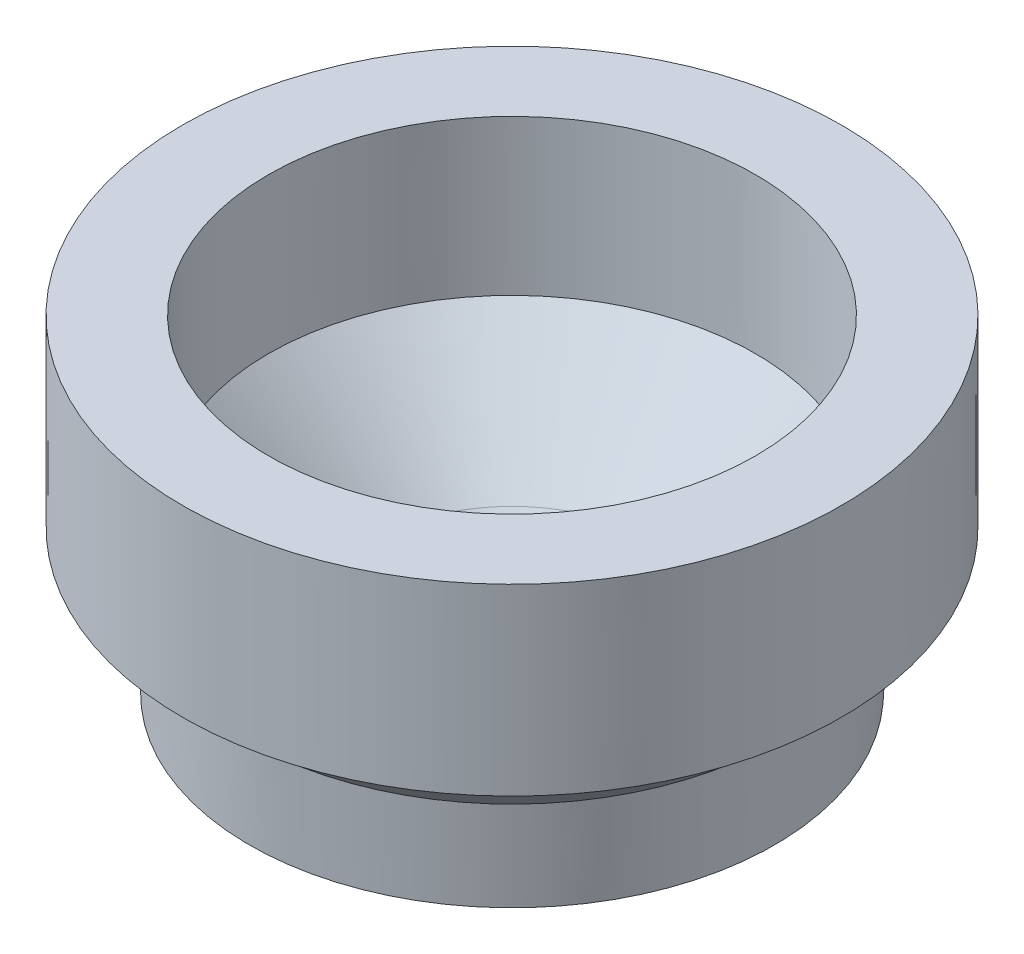
ISO-10303-21;
HEADER;
FILE_DESCRIPTION(('STEP AP214'),'2;1');
FILE_NAME('part.step','',(''),(''),'','','');
FILE_SCHEMA(('AUTOMOTIVE_DESIGN { 1 0 10303 214 1 1 1 1 }'));
ENDSEC;
DATA;
#1=APPLICATION_CONTEXT('core data for automotive mechanical design processes');
#2=APPLICATION_PROTOCOL_DEFINITION('international standard','automotive_design',2000,#1);
#3=PRODUCT_CONTEXT('',#1,'mechanical');
#4=PRODUCT('Part','Part','',(#3));
#5=PRODUCT_RELATED_PRODUCT_CATEGORY('part','',(#4));
#6=PRODUCT_DEFINITION_FORMATION('','',#4);
#7=PRODUCT_DEFINITION_CONTEXT('part definition',#1,'design');
#8=PRODUCT_DEFINITION('design','',#6,#7);
#9=PRODUCT_DEFINITION_SHAPE('','',#8);
#10=(LENGTH_UNIT() NAMED_UNIT(*) SI_UNIT(.MILLI.,.METRE.));
#11=(NAMED_UNIT(*) PLANE_ANGLE_UNIT() SI_UNIT($,.RADIAN.));
#12=(NAMED_UNIT(*) SI_UNIT($,.STERADIAN.) SOLID_ANGLE_UNIT());
#13=UNCERTAINTY_MEASURE_WITH_UNIT(LENGTH_MEASURE(1.E-05),#10,'distance_accuracy_value','');
#14=(GEOMETRIC_REPRESENTATION_CONTEXT(3) GLOBAL_UNCERTAINTY_ASSIGNED_CONTEXT((#13)) GLOBAL_UNIT_ASSIGNED_CONTEXT((#10,
#11,#12)) REPRESENTATION_CONTEXT('',''));
#15=CARTESIAN_POINT('',(0.,0.,0.));
#16=DIRECTION('',(0.,0.,1.));
#17=DIRECTION('',(1.,0.,0.));
#18=AXIS2_PLACEMENT_3D('',#15,#16,#17);
#19=CARTESIAN_POINT('',(0.,0.,0.));
#20=DIRECTION('',(4.88883233479214E-05,0.999999998804966,0.));
#21=DIRECTION('',(-0.999999998804966,4.88883233479214E-05,0.));
#22=AXIS2_PLACEMENT_3D('',#19,#20,#21);
#23=CONICAL_SURFACE('',#22,0.,1.57074743847153);
#24=CARTESIAN_POINT('',(2.44226776430036E-08,0.000499560548234725,0.));
#25=DIRECTION('',(4.88883233479214E-05,0.999999998804966,0.));
#26=DIRECTION('',(-0.999999998804966,4.88883233479214E-05,0.));
#27=AXIS2_PLACEMENT_3D('',#24,#25,#26);
#28=CIRCLE('',#27,10.2184021461929);
#29=CARTESIAN_POINT('',(-10.2184021095589,0.000999121096456896,0.));
#30=VERTEX_POINT('',#29);
#31=EDGE_CURVE('E11',#30,#30,#28,.T.);
#32=ORIENTED_EDGE('',*,*,#31,.F.);
#33=EDGE_LOOP('',(#32));
#34=FACE_BOUND('',#33,.T.);
#35=CARTESIAN_POINT('',(0.,0.,0.));
#36=VERTEX_POINT('',#35);
#37=VERTEX_LOOP('',#36);
#38=FACE_BOUND('',#37,.T.);
#39=ADVANCED_FACE('F34',(#34,#38),#23,.T.);
#40=CARTESIAN_POINT('',(2.44226776430036E-08,0.000499560548234725,0.));
#41=DIRECTION('',(4.88883233479214E-05,0.999999998804966,0.));
#42=DIRECTION('',(-0.999999998804966,4.88883233479214E-05,0.));
#43=AXIS2_PLACEMENT_3D('',#40,#41,#42);
#44=CONICAL_SURFACE('',#43,10.2184021461929,0.956579471278437);
#45=CARTESIAN_POINT('',(6.80057293243313E-05,1.39104237138772,0.));
#46=DIRECTION('',(4.88883233479214E-05,0.999999998804966,0.));
#47=DIRECTION('',(-0.999999998804966,4.88883233479214E-05,0.));
#48=AXIS2_PLACEMENT_3D('',#45,#46,#47);
#49=CIRCLE('',#48,12.1902042330944);
#50=CARTESIAN_POINT('',(-12.1901362127973,1.39163833003395,0.));
#51=VERTEX_POINT('',#50);
#52=EDGE_CURVE('E41',#51,#51,#49,.T.);
#53=ORIENTED_EDGE('',*,*,#52,.F.);
#54=EDGE_LOOP('',(#53));
#55=FACE_BOUND('',#54,.T.);
#56=ORIENTED_EDGE('',*,*,#31,.T.);
#57=EDGE_LOOP('',(#56));
#58=FACE_BOUND('',#57,.T.);
#59=ADVANCED_FACE('F83',(#55,#58),#44,.T.);
#60=CARTESIAN_POINT('',(6.80057293243313E-05,1.39104237138772,0.));
#61=DIRECTION('',(4.88883233479214E-05,0.999999998804966,0.));
#62=DIRECTION('',(-0.999999998804966,4.88883233479214E-05,0.));
#63=AXIS2_PLACEMENT_3D('',#60,#61,#62);
#64=CONICAL_SURFACE('',#63,12.1902042330944,0.046428817548589);
#65=CARTESIAN_POINT('',(0.000278566124509343,5.69800936297177,0.));
#66=DIRECTION('',(4.88883233479214E-05,0.999999998804966,0.));
#67=DIRECTION('',(-0.999999998804966,4.88883233479214E-05,0.));
#68=AXIS2_PLACEMENT_3D('',#65,#66,#67);
#69=CIRCLE('',#68,12.3903154275462);
#70=CARTESIAN_POINT('',(-12.3900368466148,5.69861510471878,0.));
#71=VERTEX_POINT('',#70);
#72=EDGE_CURVE('E76',#71,#71,#69,.T.);
#73=ORIENTED_EDGE('',*,*,#72,.F.);
#74=EDGE_LOOP('',(#73));
#75=FACE_BOUND('',#74,.T.);
#76=ORIENTED_EDGE('',*,*,#52,.T.);
#77=EDGE_LOOP('',(#76));
#78=FACE_BOUND('',#77,.T.);
#79=ADVANCED_FACE('F81',(#75,#78),#64,.T.);
#80=CARTESIAN_POINT('',(0.000278566124509343,5.69800936297177,0.));
#81=DIRECTION('',(4.88883233479214E-05,0.999999998804966,0.));
#82=DIRECTION('',(-0.999999998804966,4.88883233479214E-05,0.));
#83=AXIS2_PLACEMENT_3D('',#80,#81,#82);
#84=CONICAL_SURFACE('',#83,12.3903154275462,0.836970734870803);
#85=CARTESIAN_POINT('',(0.000394736180475153,8.07424253833023,0.));
#86=DIRECTION('',(4.88883233479214E-05,0.999999998804966,0.));
#87=DIRECTION('',(-0.999999998804966,4.88883233479214E-05,0.));
#88=AXIS2_PLACEMENT_3D('',#85,#86,#87);
#89=CIRCLE('',#88,15.0252149746334);
#90=CARTESIAN_POINT('',(-15.0248202204972,8.07497709589828,0.));
#91=VERTEX_POINT('',#90);
#92=EDGE_CURVE('E73',#91,#91,#89,.T.);
#93=ORIENTED_EDGE('',*,*,#92,.F.);
#94=EDGE_LOOP('',(#93));
#95=FACE_BOUND('',#94,.T.);
#96=ORIENTED_EDGE('',*,*,#72,.T.);
#97=EDGE_LOOP('',(#96));
#98=FACE_BOUND('',#97,.T.);
#99=ADVANCED_FACE('F101',(#95,#98),#84,.T.);
#100=CARTESIAN_POINT('',(0.000394736180475153,8.07424253833023,0.));
#101=DIRECTION('',(4.88883233479214E-05,0.999999998804966,0.));
#102=DIRECTION('',(-0.999999998804966,4.88883233479214E-05,0.));
#103=AXIS2_PLACEMENT_3D('',#100,#101,#102);
#104=CONICAL_SURFACE('',#103,15.0252149746334,1.57029737227398);
#105=CARTESIAN_POINT('',(0.000394742730332811,8.07437651424109,0.));
#106=DIRECTION('',(4.88883233479214E-05,0.999999998804966,0.));
#107=DIRECTION('',(-0.999999998804966,4.88883233479214E-05,0.));
#108=AXIS2_PLACEMENT_3D('',#105,#106,#107);
#109=CIRCLE('',#108,15.2937282244203);
#110=CARTESIAN_POINT('',(-15.2933334634134,8.07512419897172,0.));
#111=VERTEX_POINT('',#110);
#112=EDGE_CURVE('E70',#111,#111,#109,.T.);
#113=ORIENTED_EDGE('',*,*,#112,.F.);
#114=EDGE_LOOP('',(#113));
#115=FACE_BOUND('',#114,.T.);
#116=ORIENTED_EDGE('',*,*,#92,.T.);
#117=EDGE_LOOP('',(#116));
#118=FACE_BOUND('',#117,.T.);
#119=ADVANCED_FACE('F109',(#115,#118),#104,.T.);
#120=CARTESIAN_POINT('',(0.000394742730332811,8.07437651424109,0.));
#121=DIRECTION('',(-4.88883233479214E-05,-0.999999998804966,0.));
#122=DIRECTION('',(0.999999998804966,-4.88883233479214E-05,0.));
#123=AXIS2_PLACEMENT_3D('',#120,#121,#122);
#124=CONICAL_SURFACE('',#123,15.2937282244203,4.88883233673014E-05);
#125=CARTESIAN_POINT('',(0.000811020988057779,16.5892575475912,0.));
#126=DIRECTION('',(4.88883233479214E-05,0.999999998804966,0.));
#127=DIRECTION('',(-0.999999998804966,4.88883233479214E-05,0.));
#128=AXIS2_PLACEMENT_3D('',#125,#126,#127);
#129=CIRCLE('',#128,15.293311946162);
#130=CARTESIAN_POINT('',(-15.2925009068979,16.5900052119706,0.));
#131=VERTEX_POINT('',#130);
#132=EDGE_CURVE('E67',#131,#131,#129,.T.);
#133=ORIENTED_EDGE('',*,*,#132,.F.);
#134=EDGE_LOOP('',(#133));
#135=FACE_BOUND('',#134,.T.);
#136=ORIENTED_EDGE('',*,*,#112,.T.);
#137=EDGE_LOOP('',(#136));
#138=FACE_BOUND('',#137,.T.);
#139=ADVANCED_FACE('F117',(#135,#138),#124,.T.);
#140=CARTESIAN_POINT('',(0.000811020988057779,16.5892575475912,0.));
#141=DIRECTION('',(4.88883233479214E-05,0.999999998804966,0.));
#142=DIRECTION('',(-0.999999998804966,4.88883233479214E-05,0.));
#143=AXIS2_PLACEMENT_3D('',#140,#141,#142);
#144=CONICAL_SURFACE('',#143,15.293311946162,1.57074743847153);
#145=CARTESIAN_POINT('',(0.000811011457384571,16.5890625997479,0.));
#146=DIRECTION('',(4.88883233479214E-05,0.999999998804966,0.));
#147=DIRECTION('',(-0.999999998804966,4.88883233479214E-05,0.));
#148=AXIS2_PLACEMENT_3D('',#145,#146,#147);
#149=CIRCLE('',#148,11.305696297019);
#150=CARTESIAN_POINT('',(-11.3048852720509,16.5896153162842,0.));
#151=VERTEX_POINT('',#150);
#152=EDGE_CURVE('E64',#151,#151,#149,.T.);
#153=ORIENTED_EDGE('',*,*,#152,.F.);
#154=EDGE_LOOP('',(#153));
#155=FACE_BOUND('',#154,.T.);
#156=ORIENTED_EDGE('',*,*,#132,.T.);
#157=EDGE_LOOP('',(#156));
#158=FACE_BOUND('',#157,.T.);
#159=ADVANCED_FACE('F125',(#155,#158),#144,.F.);
#160=CARTESIAN_POINT('',(0.000811011457384571,16.5890625997479,0.));
#161=DIRECTION('',(-4.88883233479214E-05,-0.999999998804966,0.));
#162=DIRECTION('',(0.999999998804966,-4.88883233479214E-05,0.));
#163=AXIS2_PLACEMENT_3D('',#160,#161,#162);
#164=CONICAL_SURFACE('',#163,11.305696297019,4.88883233616478E-05);
#165=CARTESIAN_POINT('',(0.000459200604522315,9.39284828210577,0.));
#166=DIRECTION('',(4.88883233479214E-05,0.999999998804966,0.));
#167=DIRECTION('',(-0.999999998804966,4.88883233479214E-05,0.));
#168=AXIS2_PLACEMENT_3D('',#165,#166,#167);
#169=CIRCLE('',#168,11.3060481078722);
#170=CARTESIAN_POINT('',(-11.3055888937566,9.39340101584145,0.));
#171=VERTEX_POINT('',#170);
#172=EDGE_CURVE('E59',#171,#171,#169,.T.);
#173=ORIENTED_EDGE('',*,*,#172,.F.);
#174=EDGE_LOOP('',(#173));
#175=FACE_BOUND('',#174,.T.);
#176=ORIENTED_EDGE('',*,*,#152,.T.);
#177=EDGE_LOOP('',(#176));
#178=FACE_BOUND('',#177,.T.);
#179=ADVANCED_FACE('F133',(#175,#178),#164,.F.);
#180=CARTESIAN_POINT('',(0.000459200604522315,9.39284828210577,0.));
#181=DIRECTION('',(4.88883233479214E-05,0.999999998804966,0.));
#182=DIRECTION('',(-0.999999998804966,4.88883233479214E-05,0.));
#183=AXIS2_PLACEMENT_3D('',#180,#181,#182);
#184=CONICAL_SURFACE('',#183,11.3060481078722,0.763557234012171);
#185=CARTESIAN_POINT('',(0.000212010529217377,4.33662916715738,0.));
#186=DIRECTION('',(4.88883233479214E-05,0.999999998804966,0.));
#187=DIRECTION('',(-0.999999998804966,4.88883233479214E-05,0.));
#188=AXIS2_PLACEMENT_3D('',#185,#186,#187);
#189=CIRCLE('',#188,6.46600688548627);
#190=CARTESIAN_POINT('',(-6.46579486722996,4.33694527939277,0.));
#191=VERTEX_POINT('',#190);
#192=EDGE_CURVE('E56',#191,#191,#189,.T.);
#193=ORIENTED_EDGE('',*,*,#192,.F.);
#194=EDGE_LOOP('',(#193));
#195=FACE_BOUND('',#194,.T.);
#196=ORIENTED_EDGE('',*,*,#172,.T.);
#197=EDGE_LOOP('',(#196));
#198=FACE_BOUND('',#197,.T.);
#199=ADVANCED_FACE('F141',(#195,#198),#184,.F.);
#200=CARTESIAN_POINT('',(0.000295161536657297,6.03746490146864,0.));
#201=DIRECTION('',(4.88883233479214E-05,0.999999998804966,0.));
#202=DIRECTION('',(-0.999999998804966,4.88883233479214E-05,0.));
#203=AXIS2_PLACEMENT_3D('',#200,#201,#202);
#204=TOROIDAL_SURFACE('',#203,4.53118385269636,2.57611769339808);
#205=CARTESIAN_POINT('',(0.000169219580838062,3.46134964440407,0.));
#206=DIRECTION('',(4.88883233479214E-05,0.999999998804966,0.));
#207=DIRECTION('',(-0.999999998804966,4.88883233479214E-05,0.));
#208=AXIS2_PLACEMENT_3D('',#205,#206,#207);
#209=CIRCLE('',#208,4.52764313293869);
#210=CARTESIAN_POINT('',(-4.52747390794716,3.46157099328556,0.));
#211=VERTEX_POINT('',#210);
#212=EDGE_CURVE('E54',#211,#211,#209,.T.);
#213=ORIENTED_EDGE('',*,*,#212,.F.);
#214=EDGE_LOOP('',(#213));
#215=FACE_BOUND('',#214,.T.);
#216=ORIENTED_EDGE('',*,*,#192,.T.);
#217=EDGE_LOOP('',(#216));
#218=FACE_BOUND('',#217,.T.);
#219=ADVANCED_FACE('F50',(#215,#218),#204,.F.);
#220=CARTESIAN_POINT('',(0.000169219580838062,3.46134964440407,0.));
#221=DIRECTION('',(4.88883233479214E-05,0.999999998804966,0.));
#222=DIRECTION('',(-0.999999998804966,4.88883233479214E-05,0.));
#223=AXIS2_PLACEMENT_3D('',#220,#221,#222);
#224=CONICAL_SURFACE('',#223,4.52764313293869,1.57074743847153);
#225=CARTESIAN_POINT('',(0.000169208759462358,3.46112829552259,0.));
#226=VERTEX_POINT('',#225);
#227=VERTEX_LOOP('',#226);
#228=FACE_BOUND('',#227,.T.);
#229=ORIENTED_EDGE('',*,*,#212,.T.);
#230=EDGE_LOOP('',(#229));
#231=FACE_BOUND('',#230,.T.);
#232=ADVANCED_FACE('F47',(#228,#231),#224,.F.);
#233=CLOSED_SHELL('',(#39,#59,#79,#99,#119,#139,#159,#179,#199,#219,#232));
#234=MANIFOLD_SOLID_BREP('B2',#233);
#235=ADVANCED_BREP_SHAPE_REPRESENTATION('',(#18,#234),#14);
#236=SHAPE_DEFINITION_REPRESENTATION(#9,#235);
ENDSEC;
END-ISO-10303-21;
